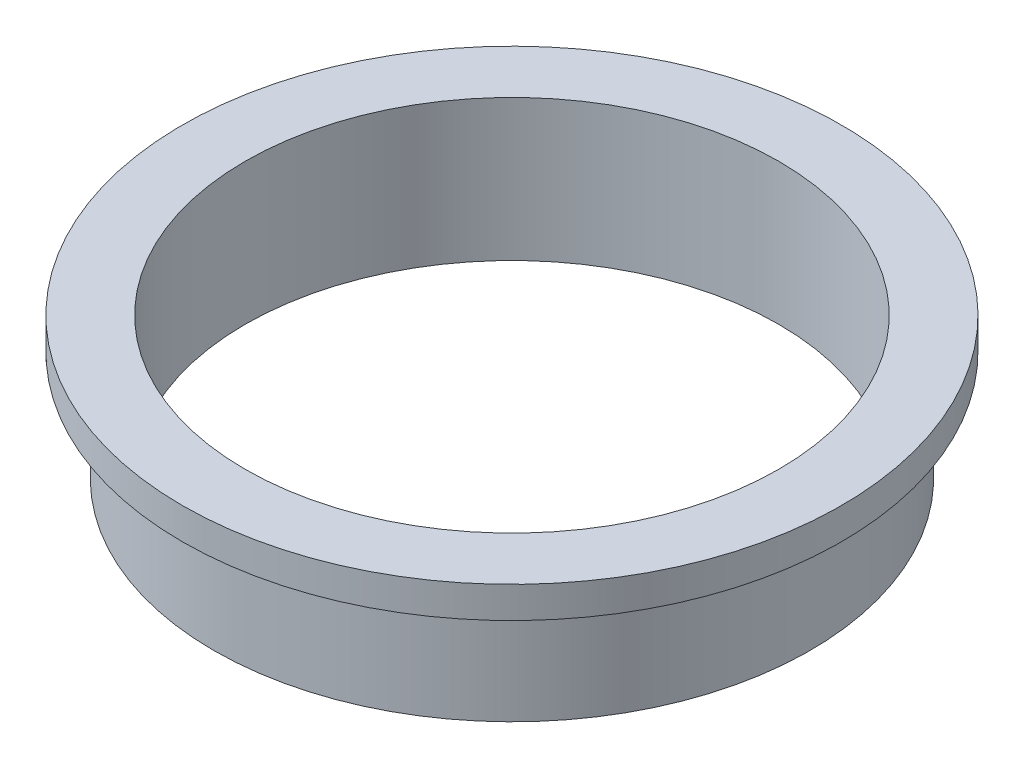
ISO-10303-21;
HEADER;
FILE_DESCRIPTION(('STEP AP214'),'2;1');
FILE_NAME('part.step','',(''),(''),'','','');
FILE_SCHEMA(('AUTOMOTIVE_DESIGN { 1 0 10303 214 1 1 1 1 }'));
ENDSEC;
DATA;
#1=APPLICATION_CONTEXT('core data for automotive mechanical design processes');
#2=APPLICATION_PROTOCOL_DEFINITION('international standard','automotive_design',2000,#1);
#3=PRODUCT_CONTEXT('',#1,'mechanical');
#4=PRODUCT('Part','Part','',(#3));
#5=PRODUCT_RELATED_PRODUCT_CATEGORY('part','',(#4));
#6=PRODUCT_DEFINITION_FORMATION('','',#4);
#7=PRODUCT_DEFINITION_CONTEXT('part definition',#1,'design');
#8=PRODUCT_DEFINITION('design','',#6,#7);
#9=PRODUCT_DEFINITION_SHAPE('','',#8);
#10=(LENGTH_UNIT() NAMED_UNIT(*) SI_UNIT(.MILLI.,.METRE.));
#11=(NAMED_UNIT(*) PLANE_ANGLE_UNIT() SI_UNIT($,.RADIAN.));
#12=(NAMED_UNIT(*) SI_UNIT($,.STERADIAN.) SOLID_ANGLE_UNIT());
#13=UNCERTAINTY_MEASURE_WITH_UNIT(LENGTH_MEASURE(1.E-05),#10,'distance_accuracy_value','');
#14=(GEOMETRIC_REPRESENTATION_CONTEXT(3) GLOBAL_UNCERTAINTY_ASSIGNED_CONTEXT((#13)) GLOBAL_UNIT_ASSIGNED_CONTEXT((#10,
#11,#12)) REPRESENTATION_CONTEXT('',''));
#15=CARTESIAN_POINT('',(0.,0.,0.));
#16=DIRECTION('',(0.,0.,1.));
#17=DIRECTION('',(1.,0.,0.));
#18=AXIS2_PLACEMENT_3D('',#15,#16,#17);
#19=CARTESIAN_POINT('',(0.,4.5,0.));
#20=DIRECTION('',(0.,-1.,0.));
#21=DIRECTION('',(0.,0.,-1.));
#22=AXIS2_PLACEMENT_3D('',#19,#20,#21);
#23=CYLINDRICAL_SURFACE('',#22,9.5);
#24=CARTESIAN_POINT('',(0.,0.,0.));
#25=DIRECTION('',(0.,1.,0.));
#26=DIRECTION('',(0.,0.,1.));
#27=AXIS2_PLACEMENT_3D('',#24,#25,#26);
#28=CIRCLE('',#27,9.5);
#29=CARTESIAN_POINT('',(0.,0.,9.5));
#30=VERTEX_POINT('',#29);
#31=EDGE_CURVE('E33',#30,#30,#28,.T.);
#32=ORIENTED_EDGE('',*,*,#31,.T.);
#33=EDGE_LOOP('',(#32));
#34=FACE_BOUND('',#33,.T.);
#35=CARTESIAN_POINT('',(0.,3.5,0.));
#36=DIRECTION('',(0.,1.,0.));
#37=DIRECTION('',(0.,0.,1.));
#38=AXIS2_PLACEMENT_3D('',#35,#36,#37);
#39=CIRCLE('',#38,9.5);
#40=CARTESIAN_POINT('',(0.,3.5,9.5));
#41=VERTEX_POINT('',#40);
#42=EDGE_CURVE('E10',#41,#41,#39,.T.);
#43=ORIENTED_EDGE('',*,*,#42,.F.);
#44=EDGE_LOOP('',(#43));
#45=FACE_BOUND('',#44,.T.);
#46=ADVANCED_FACE('F30',(#34,#45),#23,.T.);
#47=CARTESIAN_POINT('',(0.,4.5,0.));
#48=DIRECTION('',(0.,1.,0.));
#49=DIRECTION('',(0.,0.,1.));
#50=AXIS2_PLACEMENT_3D('',#47,#48,#49);
#51=PLANE('',#50);
#52=CARTESIAN_POINT('',(0.,4.5,0.));
#53=DIRECTION('',(0.,1.,0.));
#54=DIRECTION('',(0.,0.,1.));
#55=AXIS2_PLACEMENT_3D('',#52,#53,#54);
#56=CIRCLE('',#55,8.5);
#57=CARTESIAN_POINT('',(0.,4.5,8.5));
#58=VERTEX_POINT('',#57);
#59=EDGE_CURVE('E41',#58,#58,#56,.T.);
#60=ORIENTED_EDGE('',*,*,#59,.F.);
#61=EDGE_LOOP('',(#60));
#62=FACE_BOUND('',#61,.T.);
#63=CARTESIAN_POINT('',(0.,4.5,0.));
#64=DIRECTION('',(0.,1.,0.));
#65=DIRECTION('',(0.,0.,1.));
#66=AXIS2_PLACEMENT_3D('',#63,#64,#65);
#67=CIRCLE('',#66,10.5);
#68=CARTESIAN_POINT('',(0.,4.5,10.5));
#69=VERTEX_POINT('',#68);
#70=EDGE_CURVE('E44',#69,#69,#67,.T.);
#71=ORIENTED_EDGE('',*,*,#70,.T.);
#72=EDGE_LOOP('',(#71));
#73=FACE_BOUND('',#72,.T.);
#74=ADVANCED_FACE('F58',(#62,#73),#51,.T.);
#75=CARTESIAN_POINT('',(0.,0.,0.));
#76=DIRECTION('',(0.,1.,0.));
#77=DIRECTION('',(0.,0.,1.));
#78=AXIS2_PLACEMENT_3D('',#75,#76,#77);
#79=PLANE('',#78);
#80=ORIENTED_EDGE('',*,*,#31,.F.);
#81=EDGE_LOOP('',(#80));
#82=FACE_BOUND('',#81,.T.);
#83=CARTESIAN_POINT('',(0.,0.,0.));
#84=DIRECTION('',(0.,1.,0.));
#85=DIRECTION('',(0.,0.,1.));
#86=AXIS2_PLACEMENT_3D('',#83,#84,#85);
#87=CIRCLE('',#86,8.5);
#88=CARTESIAN_POINT('',(0.,0.,8.5));
#89=VERTEX_POINT('',#88);
#90=EDGE_CURVE('E47',#89,#89,#87,.T.);
#91=ORIENTED_EDGE('',*,*,#90,.T.);
#92=EDGE_LOOP('',(#91));
#93=FACE_BOUND('',#92,.T.);
#94=ADVANCED_FACE('F76',(#82,#93),#79,.F.);
#95=CARTESIAN_POINT('',(0.,4.5,0.));
#96=DIRECTION('',(0.,-1.,0.));
#97=DIRECTION('',(0.,0.,-1.));
#98=AXIS2_PLACEMENT_3D('',#95,#96,#97);
#99=CYLINDRICAL_SURFACE('',#98,8.5);
#100=ORIENTED_EDGE('',*,*,#59,.T.);
#101=EDGE_LOOP('',(#100));
#102=FACE_BOUND('',#101,.T.);
#103=ORIENTED_EDGE('',*,*,#90,.F.);
#104=EDGE_LOOP('',(#103));
#105=FACE_BOUND('',#104,.T.);
#106=ADVANCED_FACE('F67',(#102,#105),#99,.F.);
#107=CARTESIAN_POINT('',(0.,3.5,0.));
#108=DIRECTION('',(0.,1.,0.));
#109=DIRECTION('',(0.,0.,1.));
#110=AXIS2_PLACEMENT_3D('',#107,#108,#109);
#111=PLANE('',#110);
#112=CARTESIAN_POINT('',(0.,3.5,0.));
#113=DIRECTION('',(0.,1.,0.));
#114=DIRECTION('',(0.,0.,1.));
#115=AXIS2_PLACEMENT_3D('',#112,#113,#114);
#116=CIRCLE('',#115,10.5);
#117=CARTESIAN_POINT('',(0.,3.5,10.5));
#118=VERTEX_POINT('',#117);
#119=EDGE_CURVE('E49',#118,#118,#116,.T.);
#120=ORIENTED_EDGE('',*,*,#119,.F.);
#121=EDGE_LOOP('',(#120));
#122=FACE_BOUND('',#121,.T.);
#123=ORIENTED_EDGE('',*,*,#42,.T.);
#124=EDGE_LOOP('',(#123));
#125=FACE_BOUND('',#124,.T.);
#126=ADVANCED_FACE('F62',(#122,#125),#111,.F.);
#127=CARTESIAN_POINT('',(0.,3.5,0.));
#128=DIRECTION('',(0.,1.,0.));
#129=DIRECTION('',(0.,0.,1.));
#130=AXIS2_PLACEMENT_3D('',#127,#128,#129);
#131=CYLINDRICAL_SURFACE('',#130,10.5);
#132=ORIENTED_EDGE('',*,*,#119,.T.);
#133=EDGE_LOOP('',(#132));
#134=FACE_BOUND('',#133,.T.);
#135=ORIENTED_EDGE('',*,*,#70,.F.);
#136=EDGE_LOOP('',(#135));
#137=FACE_BOUND('',#136,.T.);
#138=ADVANCED_FACE('F60',(#134,#137),#131,.T.);
#139=CLOSED_SHELL('',(#46,#74,#94,#106,#126,#138));
#140=MANIFOLD_SOLID_BREP('B2',#139);
#141=ADVANCED_BREP_SHAPE_REPRESENTATION('',(#18,#140),#14);
#142=SHAPE_DEFINITION_REPRESENTATION(#9,#141);
ENDSEC;
END-ISO-10303-21;
